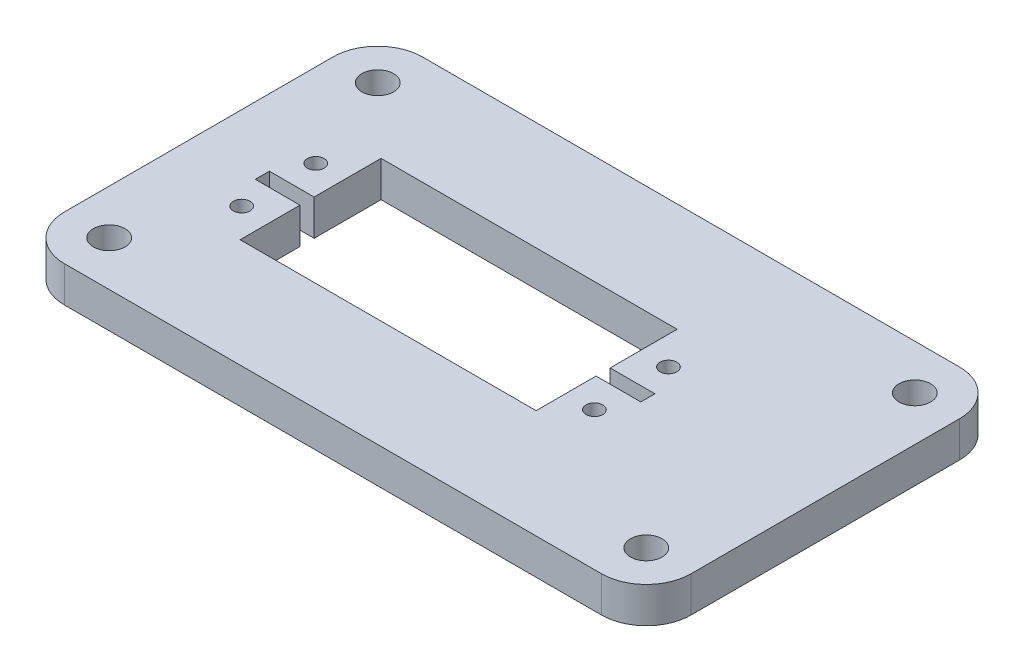
ISO-10303-21;
HEADER;
FILE_DESCRIPTION(('STEP AP214'),'2;1');
FILE_NAME('part.step','',(''),(''),'','','');
FILE_SCHEMA(('AUTOMOTIVE_DESIGN { 1 0 10303 214 1 1 1 1 }'));
ENDSEC;
DATA;
#1=APPLICATION_CONTEXT('core data for automotive mechanical design processes');
#2=APPLICATION_PROTOCOL_DEFINITION('international standard','automotive_design',2000,#1);
#3=PRODUCT_CONTEXT('',#1,'mechanical');
#4=PRODUCT('Part','Part','',(#3));
#5=PRODUCT_RELATED_PRODUCT_CATEGORY('part','',(#4));
#6=PRODUCT_DEFINITION_FORMATION('','',#4);
#7=PRODUCT_DEFINITION_CONTEXT('part definition',#1,'design');
#8=PRODUCT_DEFINITION('design','',#6,#7);
#9=PRODUCT_DEFINITION_SHAPE('','',#8);
#10=(LENGTH_UNIT() NAMED_UNIT(*) SI_UNIT(.MILLI.,.METRE.));
#11=(NAMED_UNIT(*) PLANE_ANGLE_UNIT() SI_UNIT($,.RADIAN.));
#12=(NAMED_UNIT(*) SI_UNIT($,.STERADIAN.) SOLID_ANGLE_UNIT());
#13=UNCERTAINTY_MEASURE_WITH_UNIT(LENGTH_MEASURE(1.E-05),#10,'distance_accuracy_value','');
#14=(GEOMETRIC_REPRESENTATION_CONTEXT(3) GLOBAL_UNCERTAINTY_ASSIGNED_CONTEXT((#13)) GLOBAL_UNIT_ASSIGNED_CONTEXT((#10,
#11,#12)) REPRESENTATION_CONTEXT('',''));
#15=CARTESIAN_POINT('',(0.,0.,0.));
#16=DIRECTION('',(0.,0.,1.));
#17=DIRECTION('',(1.,0.,0.));
#18=AXIS2_PLACEMENT_3D('',#15,#16,#17);
#19=CARTESIAN_POINT('',(0.,0.,0.));
#20=DIRECTION('',(0.,-1.,0.));
#21=DIRECTION('',(0.,0.,-1.));
#22=AXIS2_PLACEMENT_3D('',#19,#20,#21);
#23=PLANE('',#22);
#24=CARTESIAN_POINT('',(-82.55,0.,44.45));
#25=DIRECTION('',(0.,1.,0.));
#26=DIRECTION('',(0.,0.,1.));
#27=AXIS2_PLACEMENT_3D('',#24,#25,#26);
#28=CIRCLE('',#27,2.2479);
#29=CARTESIAN_POINT('',(-82.55,0.,46.6979));
#30=VERTEX_POINT('',#29);
#31=EDGE_CURVE('E711',#30,#30,#28,.T.);
#32=ORIENTED_EDGE('',*,*,#31,.T.);
#33=EDGE_LOOP('',(#32));
#34=FACE_BOUND('',#33,.T.);
#35=CARTESIAN_POINT('',(-6.34999999999999,0.,6.35));
#36=DIRECTION('',(0.,1.,0.));
#37=DIRECTION('',(0.,0.,1.));
#38=AXIS2_PLACEMENT_3D('',#35,#36,#37);
#39=CIRCLE('',#38,2.2479);
#40=CARTESIAN_POINT('',(-6.34999999999999,0.,8.5979));
#41=VERTEX_POINT('',#40);
#42=EDGE_CURVE('E716',#41,#41,#39,.T.);
#43=ORIENTED_EDGE('',*,*,#42,.T.);
#44=EDGE_LOOP('',(#43));
#45=FACE_BOUND('',#44,.T.);
#46=CARTESIAN_POINT('',(-6.35,0.,44.45));
#47=DIRECTION('',(0.,1.,0.));
#48=DIRECTION('',(0.,0.,1.));
#49=AXIS2_PLACEMENT_3D('',#46,#47,#48);
#50=CIRCLE('',#49,2.2479);
#51=CARTESIAN_POINT('',(-6.35,0.,46.6979));
#52=VERTEX_POINT('',#51);
#53=EDGE_CURVE('E202',#52,#52,#50,.T.);
#54=ORIENTED_EDGE('',*,*,#53,.T.);
#55=EDGE_LOOP('',(#54));
#56=FACE_BOUND('',#55,.T.);
#57=DIRECTION('',(1.,0.,0.));
#58=VECTOR('',#57,1.);
#59=CARTESIAN_POINT('',(-73.025,0.,26.9));
#60=LINE('',#59,#58);
#61=CARTESIAN_POINT('',(-79.375,0.,26.9));
#62=VERTEX_POINT('',#61);
#63=CARTESIAN_POINT('',(-73.025,0.,26.9));
#64=VERTEX_POINT('',#63);
#65=EDGE_CURVE('E190',#62,#64,#60,.T.);
#66=ORIENTED_EDGE('',*,*,#65,.T.);
#67=DIRECTION('',(0.,0.,1.));
#68=VECTOR('',#67,1.);
#69=CARTESIAN_POINT('',(-73.025,0.,15.4));
#70=LINE('',#69,#68);
#71=CARTESIAN_POINT('',(-73.025,0.,35.4));
#72=VERTEX_POINT('',#71);
#73=EDGE_CURVE('E282',#64,#72,#70,.T.);
#74=ORIENTED_EDGE('',*,*,#73,.T.);
#75=DIRECTION('',(1.,0.,0.));
#76=VECTOR('',#75,1.);
#77=CARTESIAN_POINT('',(-73.025,0.,35.4));
#78=LINE('',#77,#76);
#79=CARTESIAN_POINT('',(-31.0249824,0.,35.4));
#80=VERTEX_POINT('',#79);
#81=EDGE_CURVE('E284',#72,#80,#78,.T.);
#82=ORIENTED_EDGE('',*,*,#81,.T.);
#83=DIRECTION('',(0.,0.,-1.));
#84=VECTOR('',#83,1.);
#85=CARTESIAN_POINT('',(-31.0249824,0.,15.4));
#86=LINE('',#85,#84);
#87=CARTESIAN_POINT('',(-31.0249824,0.,26.9));
#88=VERTEX_POINT('',#87);
#89=EDGE_CURVE('E277',#80,#88,#86,.T.);
#90=ORIENTED_EDGE('',*,*,#89,.T.);
#91=DIRECTION('',(1.,0.,0.));
#92=VECTOR('',#91,1.);
#93=CARTESIAN_POINT('',(-31.0249824,0.,26.9));
#94=LINE('',#93,#92);
#95=CARTESIAN_POINT('',(-24.6749824,0.,26.9));
#96=VERTEX_POINT('',#95);
#97=EDGE_CURVE('E215',#88,#96,#94,.T.);
#98=ORIENTED_EDGE('',*,*,#97,.T.);
#99=DIRECTION('',(0.,0.,-1.));
#100=VECTOR('',#99,1.);
#101=CARTESIAN_POINT('',(-24.6749824,0.,24.9));
#102=LINE('',#101,#100);
#103=CARTESIAN_POINT('',(-24.6749824,0.,24.9));
#104=VERTEX_POINT('',#103);
#105=EDGE_CURVE('E218',#96,#104,#102,.T.);
#106=ORIENTED_EDGE('',*,*,#105,.T.);
#107=DIRECTION('',(-1.,0.,0.));
#108=VECTOR('',#107,1.);
#109=CARTESIAN_POINT('',(-31.0249824,0.,24.9));
#110=LINE('',#109,#108);
#111=CARTESIAN_POINT('',(-31.0249824,0.,24.9));
#112=VERTEX_POINT('',#111);
#113=EDGE_CURVE('E222',#104,#112,#110,.T.);
#114=ORIENTED_EDGE('',*,*,#113,.T.);
#115=CARTESIAN_POINT('',(-31.0249824,0.,15.4));
#116=VERTEX_POINT('',#115);
#117=EDGE_CURVE('E263',#112,#116,#86,.T.);
#118=ORIENTED_EDGE('',*,*,#117,.T.);
#119=DIRECTION('',(-1.,0.,0.));
#120=VECTOR('',#119,1.);
#121=CARTESIAN_POINT('',(-31.0249824,0.,15.4));
#122=LINE('',#121,#120);
#123=CARTESIAN_POINT('',(-73.025,0.,15.4));
#124=VERTEX_POINT('',#123);
#125=EDGE_CURVE('E280',#116,#124,#122,.T.);
#126=ORIENTED_EDGE('',*,*,#125,.T.);
#127=CARTESIAN_POINT('',(-73.025,0.,24.9));
#128=VERTEX_POINT('',#127);
#129=EDGE_CURVE('E196',#124,#128,#70,.T.);
#130=ORIENTED_EDGE('',*,*,#129,.T.);
#131=DIRECTION('',(-1.,0.,0.));
#132=VECTOR('',#131,1.);
#133=CARTESIAN_POINT('',(-73.025,0.,24.9));
#134=LINE('',#133,#132);
#135=CARTESIAN_POINT('',(-79.375,0.,24.9));
#136=VERTEX_POINT('',#135);
#137=EDGE_CURVE('E174',#128,#136,#134,.T.);
#138=ORIENTED_EDGE('',*,*,#137,.T.);
#139=DIRECTION('',(0.,0.,1.));
#140=VECTOR('',#139,1.);
#141=CARTESIAN_POINT('',(-79.375,0.,24.9));
#142=LINE('',#141,#140);
#143=EDGE_CURVE('E185',#136,#62,#142,.T.);
#144=ORIENTED_EDGE('',*,*,#143,.T.);
#145=EDGE_LOOP('',(#66,#74,#82,#90,#98,#106,#114,#118,#126,#130,#138,#144));
#146=FACE_BOUND('',#145,.T.);
#147=CARTESIAN_POINT('',(-77.0439912,0.,31.15));
#148=DIRECTION('',(0.,1.,0.));
#149=DIRECTION('',(0.,0.,1.));
#150=AXIS2_PLACEMENT_3D('',#147,#148,#149);
#151=CIRCLE('',#150,1.190625);
#152=CARTESIAN_POINT('',(-77.0439912,0.,32.340625));
#153=VERTEX_POINT('',#152);
#154=EDGE_CURVE('E242',#153,#153,#151,.T.);
#155=ORIENTED_EDGE('',*,*,#154,.T.);
#156=EDGE_LOOP('',(#155));
#157=FACE_BOUND('',#156,.T.);
#158=CARTESIAN_POINT('',(-77.0439912,0.,20.65));
#159=DIRECTION('',(0.,1.,0.));
#160=DIRECTION('',(0.,0.,1.));
#161=AXIS2_PLACEMENT_3D('',#158,#159,#160);
#162=CIRCLE('',#161,1.190625);
#163=CARTESIAN_POINT('',(-77.0439912,0.,21.840625));
#164=VERTEX_POINT('',#163);
#165=EDGE_CURVE('E248',#164,#164,#162,.T.);
#166=ORIENTED_EDGE('',*,*,#165,.T.);
#167=EDGE_LOOP('',(#166));
#168=FACE_BOUND('',#167,.T.);
#169=CARTESIAN_POINT('',(-27.0059912,0.,31.15));
#170=DIRECTION('',(0.,1.,0.));
#171=DIRECTION('',(0.,0.,1.));
#172=AXIS2_PLACEMENT_3D('',#169,#170,#171);
#173=CIRCLE('',#172,1.190625);
#174=CARTESIAN_POINT('',(-27.0059912,0.,32.340625));
#175=VERTEX_POINT('',#174);
#176=EDGE_CURVE('E254',#175,#175,#173,.T.);
#177=ORIENTED_EDGE('',*,*,#176,.T.);
#178=EDGE_LOOP('',(#177));
#179=FACE_BOUND('',#178,.T.);
#180=CARTESIAN_POINT('',(-27.0059912,0.,20.65));
#181=DIRECTION('',(0.,1.,0.));
#182=DIRECTION('',(0.,0.,1.));
#183=AXIS2_PLACEMENT_3D('',#180,#181,#182);
#184=CIRCLE('',#183,1.190625);
#185=CARTESIAN_POINT('',(-27.0059912,0.,21.840625));
#186=VERTEX_POINT('',#185);
#187=EDGE_CURVE('E260',#186,#186,#184,.T.);
#188=ORIENTED_EDGE('',*,*,#187,.T.);
#189=EDGE_LOOP('',(#188));
#190=FACE_BOUND('',#189,.T.);
#191=DIRECTION('',(0.,0.,-1.));
#192=VECTOR('',#191,1.);
#193=CARTESIAN_POINT('',(0.,0.,0.));
#194=LINE('',#193,#192);
#195=CARTESIAN_POINT('',(0.,0.,44.45));
#196=VERTEX_POINT('',#195);
#197=CARTESIAN_POINT('',(0.,0.,6.35));
#198=VERTEX_POINT('',#197);
#199=EDGE_CURVE('E315',#196,#198,#194,.T.);
#200=ORIENTED_EDGE('',*,*,#199,.F.);
#201=CARTESIAN_POINT('',(-6.35,0.,44.45));
#202=DIRECTION('',(0.,-1.,0.));
#203=DIRECTION('',(0.,0.,-1.));
#204=AXIS2_PLACEMENT_3D('',#201,#202,#203);
#205=CIRCLE('',#204,6.35);
#206=CARTESIAN_POINT('',(-6.35,0.,50.8));
#207=VERTEX_POINT('',#206);
#208=EDGE_CURVE('E329',#196,#207,#205,.T.);
#209=ORIENTED_EDGE('',*,*,#208,.T.);
#210=DIRECTION('',(1.,0.,0.));
#211=VECTOR('',#210,1.);
#212=CARTESIAN_POINT('',(0.,0.,50.8));
#213=LINE('',#212,#211);
#214=CARTESIAN_POINT('',(-82.55,0.,50.8));
#215=VERTEX_POINT('',#214);
#216=EDGE_CURVE('E312',#215,#207,#213,.T.);
#217=ORIENTED_EDGE('',*,*,#216,.F.);
#218=CARTESIAN_POINT('',(-82.55,0.,44.45));
#219=DIRECTION('',(0.,-1.,0.));
#220=DIRECTION('',(0.,0.,-1.));
#221=AXIS2_PLACEMENT_3D('',#218,#219,#220);
#222=CIRCLE('',#221,6.35);
#223=CARTESIAN_POINT('',(-88.9,0.,44.45));
#224=VERTEX_POINT('',#223);
#225=EDGE_CURVE('E325',#215,#224,#222,.T.);
#226=ORIENTED_EDGE('',*,*,#225,.T.);
#227=DIRECTION('',(0.,0.,1.));
#228=VECTOR('',#227,1.);
#229=CARTESIAN_POINT('',(-88.9,0.,50.8));
#230=LINE('',#229,#228);
#231=CARTESIAN_POINT('',(-88.9,0.,6.35));
#232=VERTEX_POINT('',#231);
#233=EDGE_CURVE('E297',#232,#224,#230,.T.);
#234=ORIENTED_EDGE('',*,*,#233,.F.);
#235=CARTESIAN_POINT('',(-82.55,0.,6.35));
#236=DIRECTION('',(0.,-1.,0.));
#237=DIRECTION('',(0.,0.,-1.));
#238=AXIS2_PLACEMENT_3D('',#235,#236,#237);
#239=CIRCLE('',#238,6.35);
#240=CARTESIAN_POINT('',(-82.55,0.,0.));
#241=VERTEX_POINT('',#240);
#242=EDGE_CURVE('E323',#232,#241,#239,.T.);
#243=ORIENTED_EDGE('',*,*,#242,.T.);
#244=DIRECTION('',(-1.,0.,0.));
#245=VECTOR('',#244,1.);
#246=CARTESIAN_POINT('',(-88.9,0.,0.));
#247=LINE('',#246,#245);
#248=CARTESIAN_POINT('',(-6.34999999999999,0.,0.));
#249=VERTEX_POINT('',#248);
#250=EDGE_CURVE('E302',#249,#241,#247,.T.);
#251=ORIENTED_EDGE('',*,*,#250,.F.);
#252=CARTESIAN_POINT('',(-6.34999999999999,0.,6.35));
#253=DIRECTION('',(0.,-1.,0.));
#254=DIRECTION('',(0.,0.,-1.));
#255=AXIS2_PLACEMENT_3D('',#252,#253,#254);
#256=CIRCLE('',#255,6.35);
#257=EDGE_CURVE('E327',#249,#198,#256,.T.);
#258=ORIENTED_EDGE('',*,*,#257,.T.);
#259=EDGE_LOOP('',(#200,#209,#217,#226,#234,#243,#251,#258));
#260=FACE_BOUND('',#259,.T.);
#261=CARTESIAN_POINT('',(-82.55,0.,6.35));
#262=DIRECTION('',(0.,1.,0.));
#263=DIRECTION('',(0.,0.,1.));
#264=AXIS2_PLACEMENT_3D('',#261,#262,#263);
#265=CIRCLE('',#264,2.2479);
#266=CARTESIAN_POINT('',(-82.55,0.,8.5979));
#267=VERTEX_POINT('',#266);
#268=EDGE_CURVE('E701',#267,#267,#265,.T.);
#269=ORIENTED_EDGE('',*,*,#268,.T.);
#270=EDGE_LOOP('',(#269));
#271=FACE_BOUND('',#270,.T.);
#272=ADVANCED_FACE('F33',(#34,#45,#56,#146,#157,#168,#179,#190,#260,#271),#23,.T.);
#273=CARTESIAN_POINT('',(-31.0249824,5.08,15.4));
#274=DIRECTION('',(-1.,0.,0.));
#275=DIRECTION('',(0.,0.,1.));
#276=AXIS2_PLACEMENT_3D('',#273,#274,#275);
#277=PLANE('',#276);
#278=DIRECTION('',(0.,1.,0.));
#279=VECTOR('',#278,1.);
#280=CARTESIAN_POINT('',(-31.0249824,0.,24.9));
#281=LINE('',#280,#279);
#282=CARTESIAN_POINT('',(-31.0249824,5.08,24.9));
#283=VERTEX_POINT('',#282);
#284=EDGE_CURVE('E207',#112,#283,#281,.T.);
#285=ORIENTED_EDGE('',*,*,#284,.T.);
#286=DIRECTION('',(0.,0.,-1.));
#287=VECTOR('',#286,1.);
#288=CARTESIAN_POINT('',(-31.0249824,5.08,15.4));
#289=LINE('',#288,#287);
#290=CARTESIAN_POINT('',(-31.0249824,5.08,15.4));
#291=VERTEX_POINT('',#290);
#292=EDGE_CURVE('E268',#283,#291,#289,.T.);
#293=ORIENTED_EDGE('',*,*,#292,.T.);
#294=DIRECTION('',(0.,-1.,0.));
#295=VECTOR('',#294,1.);
#296=CARTESIAN_POINT('',(-31.0249824,5.08,15.4));
#297=LINE('',#296,#295);
#298=EDGE_CURVE('E294',#291,#116,#297,.T.);
#299=ORIENTED_EDGE('',*,*,#298,.T.);
#300=ORIENTED_EDGE('',*,*,#117,.F.);
#301=EDGE_LOOP('',(#285,#293,#299,#300));
#302=FACE_BOUND('',#301,.T.);
#303=ADVANCED_FACE('F392',(#302),#277,.T.);
#304=CARTESIAN_POINT('',(-73.025,5.08,15.4));
#305=DIRECTION('',(1.,0.,0.));
#306=DIRECTION('',(0.,0.,-1.));
#307=AXIS2_PLACEMENT_3D('',#304,#305,#306);
#308=PLANE('',#307);
#309=DIRECTION('',(0.,1.,0.));
#310=VECTOR('',#309,1.);
#311=CARTESIAN_POINT('',(-73.025,0.,26.9));
#312=LINE('',#311,#310);
#313=CARTESIAN_POINT('',(-73.025,5.08,26.9));
#314=VERTEX_POINT('',#313);
#315=EDGE_CURVE('E209',#64,#314,#312,.T.);
#316=ORIENTED_EDGE('',*,*,#315,.T.);
#317=DIRECTION('',(0.,0.,1.));
#318=VECTOR('',#317,1.);
#319=CARTESIAN_POINT('',(-73.025,5.08,15.4));
#320=LINE('',#319,#318);
#321=CARTESIAN_POINT('',(-73.025,5.08,35.4));
#322=VERTEX_POINT('',#321);
#323=EDGE_CURVE('E270',#314,#322,#320,.T.);
#324=ORIENTED_EDGE('',*,*,#323,.T.);
#325=DIRECTION('',(0.,-1.,0.));
#326=VECTOR('',#325,1.);
#327=CARTESIAN_POINT('',(-73.025,5.08,35.4));
#328=LINE('',#327,#326);
#329=EDGE_CURVE('E289',#322,#72,#328,.T.);
#330=ORIENTED_EDGE('',*,*,#329,.T.);
#331=ORIENTED_EDGE('',*,*,#73,.F.);
#332=EDGE_LOOP('',(#316,#324,#330,#331));
#333=FACE_BOUND('',#332,.T.);
#334=ADVANCED_FACE('F398',(#333),#308,.T.);
#335=CARTESIAN_POINT('',(0.,5.08,0.));
#336=DIRECTION('',(0.,-1.,0.));
#337=DIRECTION('',(0.,0.,-1.));
#338=AXIS2_PLACEMENT_3D('',#335,#336,#337);
#339=PLANE('',#338);
#340=CARTESIAN_POINT('',(-82.55,5.08,6.35));
#341=DIRECTION('',(0.,1.,0.));
#342=DIRECTION('',(0.,0.,1.));
#343=AXIS2_PLACEMENT_3D('',#340,#341,#342);
#344=CIRCLE('',#343,2.2479);
#345=CARTESIAN_POINT('',(-82.55,5.08,8.5979));
#346=VERTEX_POINT('',#345);
#347=EDGE_CURVE('E704',#346,#346,#344,.T.);
#348=ORIENTED_EDGE('',*,*,#347,.F.);
#349=EDGE_LOOP('',(#348));
#350=FACE_BOUND('',#349,.T.);
#351=CARTESIAN_POINT('',(-82.55,5.08,44.45));
#352=DIRECTION('',(0.,1.,0.));
#353=DIRECTION('',(0.,0.,1.));
#354=AXIS2_PLACEMENT_3D('',#351,#352,#353);
#355=CIRCLE('',#354,2.2479);
#356=CARTESIAN_POINT('',(-82.55,5.08,46.6979));
#357=VERTEX_POINT('',#356);
#358=EDGE_CURVE('E706',#357,#357,#355,.T.);
#359=ORIENTED_EDGE('',*,*,#358,.F.);
#360=EDGE_LOOP('',(#359));
#361=FACE_BOUND('',#360,.T.);
#362=CARTESIAN_POINT('',(-6.34999999999999,5.08,6.35));
#363=DIRECTION('',(0.,1.,0.));
#364=DIRECTION('',(0.,0.,1.));
#365=AXIS2_PLACEMENT_3D('',#362,#363,#364);
#366=CIRCLE('',#365,2.2479);
#367=CARTESIAN_POINT('',(-6.34999999999999,5.08,8.5979));
#368=VERTEX_POINT('',#367);
#369=EDGE_CURVE('E713',#368,#368,#366,.T.);
#370=ORIENTED_EDGE('',*,*,#369,.F.);
#371=EDGE_LOOP('',(#370));
#372=FACE_BOUND('',#371,.T.);
#373=CARTESIAN_POINT('',(-6.35,5.08,44.45));
#374=DIRECTION('',(0.,1.,0.));
#375=DIRECTION('',(0.,0.,1.));
#376=AXIS2_PLACEMENT_3D('',#373,#374,#375);
#377=CIRCLE('',#376,2.2479);
#378=CARTESIAN_POINT('',(-6.35,5.08,46.6979));
#379=VERTEX_POINT('',#378);
#380=EDGE_CURVE('E718',#379,#379,#377,.T.);
#381=ORIENTED_EDGE('',*,*,#380,.F.);
#382=EDGE_LOOP('',(#381));
#383=FACE_BOUND('',#382,.T.);
#384=CARTESIAN_POINT('',(-77.0439912,5.08,31.15));
#385=DIRECTION('',(0.,1.,0.));
#386=DIRECTION('',(0.,0.,1.));
#387=AXIS2_PLACEMENT_3D('',#384,#385,#386);
#388=CIRCLE('',#387,1.190625);
#389=CARTESIAN_POINT('',(-77.0439912,5.08,32.340625));
#390=VERTEX_POINT('',#389);
#391=EDGE_CURVE('E212',#390,#390,#388,.T.);
#392=ORIENTED_EDGE('',*,*,#391,.F.);
#393=EDGE_LOOP('',(#392));
#394=FACE_BOUND('',#393,.T.);
#395=CARTESIAN_POINT('',(-77.0439912,5.08,20.65));
#396=DIRECTION('',(0.,1.,0.));
#397=DIRECTION('',(0.,0.,1.));
#398=AXIS2_PLACEMENT_3D('',#395,#396,#397);
#399=CIRCLE('',#398,1.190625);
#400=CARTESIAN_POINT('',(-77.0439912,5.08,21.840625));
#401=VERTEX_POINT('',#400);
#402=EDGE_CURVE('E245',#401,#401,#399,.T.);
#403=ORIENTED_EDGE('',*,*,#402,.F.);
#404=EDGE_LOOP('',(#403));
#405=FACE_BOUND('',#404,.T.);
#406=CARTESIAN_POINT('',(-27.0059912,5.08,31.15));
#407=DIRECTION('',(0.,1.,0.));
#408=DIRECTION('',(0.,0.,1.));
#409=AXIS2_PLACEMENT_3D('',#406,#407,#408);
#410=CIRCLE('',#409,1.190625);
#411=CARTESIAN_POINT('',(-27.0059912,5.08,32.340625));
#412=VERTEX_POINT('',#411);
#413=EDGE_CURVE('E251',#412,#412,#410,.T.);
#414=ORIENTED_EDGE('',*,*,#413,.F.);
#415=EDGE_LOOP('',(#414));
#416=FACE_BOUND('',#415,.T.);
#417=CARTESIAN_POINT('',(-27.0059912,5.08,20.65));
#418=DIRECTION('',(0.,1.,0.));
#419=DIRECTION('',(0.,0.,1.));
#420=AXIS2_PLACEMENT_3D('',#417,#418,#419);
#421=CIRCLE('',#420,1.190625);
#422=CARTESIAN_POINT('',(-27.0059912,5.08,21.840625));
#423=VERTEX_POINT('',#422);
#424=EDGE_CURVE('E257',#423,#423,#421,.T.);
#425=ORIENTED_EDGE('',*,*,#424,.F.);
#426=EDGE_LOOP('',(#425));
#427=FACE_BOUND('',#426,.T.);
#428=DIRECTION('',(1.,0.,0.));
#429=VECTOR('',#428,1.);
#430=CARTESIAN_POINT('',(0.,5.08,50.8));
#431=LINE('',#430,#429);
#432=CARTESIAN_POINT('',(-82.55,5.08,50.8));
#433=VERTEX_POINT('',#432);
#434=CARTESIAN_POINT('',(-6.35,5.08,50.8));
#435=VERTEX_POINT('',#434);
#436=EDGE_CURVE('E301',#433,#435,#431,.T.);
#437=ORIENTED_EDGE('',*,*,#436,.T.);
#438=CARTESIAN_POINT('',(-6.35,5.08,44.45));
#439=DIRECTION('',(0.,-1.,0.));
#440=DIRECTION('',(0.,0.,-1.));
#441=AXIS2_PLACEMENT_3D('',#438,#439,#440);
#442=CIRCLE('',#441,6.35);
#443=CARTESIAN_POINT('',(0.,5.08,44.45));
#444=VERTEX_POINT('',#443);
#445=EDGE_CURVE('E341',#435,#444,#442,.F.);
#446=ORIENTED_EDGE('',*,*,#445,.T.);
#447=DIRECTION('',(0.,0.,-1.));
#448=VECTOR('',#447,1.);
#449=CARTESIAN_POINT('',(0.,5.08,0.));
#450=LINE('',#449,#448);
#451=CARTESIAN_POINT('',(0.,5.08,6.35));
#452=VERTEX_POINT('',#451);
#453=EDGE_CURVE('E305',#444,#452,#450,.T.);
#454=ORIENTED_EDGE('',*,*,#453,.T.);
#455=CARTESIAN_POINT('',(-6.34999999999999,5.08,6.35));
#456=DIRECTION('',(0.,-1.,0.));
#457=DIRECTION('',(0.,0.,-1.));
#458=AXIS2_PLACEMENT_3D('',#455,#456,#457);
#459=CIRCLE('',#458,6.35);
#460=CARTESIAN_POINT('',(-6.34999999999999,5.08,0.));
#461=VERTEX_POINT('',#460);
#462=EDGE_CURVE('E55',#452,#461,#459,.F.);
#463=ORIENTED_EDGE('',*,*,#462,.T.);
#464=DIRECTION('',(-1.,0.,0.));
#465=VECTOR('',#464,1.);
#466=CARTESIAN_POINT('',(-88.9,5.08,0.));
#467=LINE('',#466,#465);
#468=CARTESIAN_POINT('',(-82.55,5.08,0.));
#469=VERTEX_POINT('',#468);
#470=EDGE_CURVE('E307',#461,#469,#467,.T.);
#471=ORIENTED_EDGE('',*,*,#470,.T.);
#472=CARTESIAN_POINT('',(-82.55,5.08,6.35));
#473=DIRECTION('',(0.,-1.,0.));
#474=DIRECTION('',(0.,0.,-1.));
#475=AXIS2_PLACEMENT_3D('',#472,#473,#474);
#476=CIRCLE('',#475,6.35);
#477=CARTESIAN_POINT('',(-88.9,5.08,6.35));
#478=VERTEX_POINT('',#477);
#479=EDGE_CURVE('E336',#469,#478,#476,.F.);
#480=ORIENTED_EDGE('',*,*,#479,.T.);
#481=DIRECTION('',(0.,0.,1.));
#482=VECTOR('',#481,1.);
#483=CARTESIAN_POINT('',(-88.9,5.08,50.8));
#484=LINE('',#483,#482);
#485=CARTESIAN_POINT('',(-88.9,5.08,44.45));
#486=VERTEX_POINT('',#485);
#487=EDGE_CURVE('E298',#478,#486,#484,.T.);
#488=ORIENTED_EDGE('',*,*,#487,.T.);
#489=CARTESIAN_POINT('',(-82.55,5.08,44.45));
#490=DIRECTION('',(0.,-1.,0.));
#491=DIRECTION('',(0.,0.,-1.));
#492=AXIS2_PLACEMENT_3D('',#489,#490,#491);
#493=CIRCLE('',#492,6.35);
#494=EDGE_CURVE('E338',#486,#433,#493,.F.);
#495=ORIENTED_EDGE('',*,*,#494,.T.);
#496=EDGE_LOOP('',(#437,#446,#454,#463,#471,#480,#488,#495));
#497=FACE_BOUND('',#496,.T.);
#498=ORIENTED_EDGE('',*,*,#323,.F.);
#499=DIRECTION('',(1.,0.,0.));
#500=VECTOR('',#499,1.);
#501=CARTESIAN_POINT('',(-73.025,5.08,26.9));
#502=LINE('',#501,#500);
#503=CARTESIAN_POINT('',(-79.375,5.08,26.9));
#504=VERTEX_POINT('',#503);
#505=EDGE_CURVE('E197',#504,#314,#502,.T.);
#506=ORIENTED_EDGE('',*,*,#505,.F.);
#507=DIRECTION('',(0.,0.,1.));
#508=VECTOR('',#507,1.);
#509=CARTESIAN_POINT('',(-79.375,5.08,24.9));
#510=LINE('',#509,#508);
#511=CARTESIAN_POINT('',(-79.375,5.08,24.9));
#512=VERTEX_POINT('',#511);
#513=EDGE_CURVE('E199',#512,#504,#510,.T.);
#514=ORIENTED_EDGE('',*,*,#513,.F.);
#515=DIRECTION('',(-1.,0.,0.));
#516=VECTOR('',#515,1.);
#517=CARTESIAN_POINT('',(-73.025,5.08,24.9));
#518=LINE('',#517,#516);
#519=CARTESIAN_POINT('',(-73.025,5.08,24.9));
#520=VERTEX_POINT('',#519);
#521=EDGE_CURVE('E177',#520,#512,#518,.T.);
#522=ORIENTED_EDGE('',*,*,#521,.F.);
#523=CARTESIAN_POINT('',(-73.025,5.08,15.4));
#524=VERTEX_POINT('',#523);
#525=EDGE_CURVE('E271',#524,#520,#320,.T.);
#526=ORIENTED_EDGE('',*,*,#525,.F.);
#527=DIRECTION('',(-1.,0.,0.));
#528=VECTOR('',#527,1.);
#529=CARTESIAN_POINT('',(-31.0249824,5.08,15.4));
#530=LINE('',#529,#528);
#531=EDGE_CURVE('E267',#291,#524,#530,.T.);
#532=ORIENTED_EDGE('',*,*,#531,.F.);
#533=ORIENTED_EDGE('',*,*,#292,.F.);
#534=DIRECTION('',(-1.,0.,0.));
#535=VECTOR('',#534,1.);
#536=CARTESIAN_POINT('',(-31.0249824,5.08,24.9));
#537=LINE('',#536,#535);
#538=CARTESIAN_POINT('',(-24.6749824,5.08,24.9));
#539=VERTEX_POINT('',#538);
#540=EDGE_CURVE('E219',#539,#283,#537,.T.);
#541=ORIENTED_EDGE('',*,*,#540,.F.);
#542=DIRECTION('',(0.,0.,-1.));
#543=VECTOR('',#542,1.);
#544=CARTESIAN_POINT('',(-24.6749824,5.08,24.9));
#545=LINE('',#544,#543);
#546=CARTESIAN_POINT('',(-24.6749824,5.08,26.9));
#547=VERTEX_POINT('',#546);
#548=EDGE_CURVE('E229',#547,#539,#545,.T.);
#549=ORIENTED_EDGE('',*,*,#548,.F.);
#550=DIRECTION('',(1.,0.,0.));
#551=VECTOR('',#550,1.);
#552=CARTESIAN_POINT('',(-31.0249824,5.08,26.9));
#553=LINE('',#552,#551);
#554=CARTESIAN_POINT('',(-31.0249824,5.08,26.9));
#555=VERTEX_POINT('',#554);
#556=EDGE_CURVE('E226',#555,#547,#553,.T.);
#557=ORIENTED_EDGE('',*,*,#556,.F.);
#558=CARTESIAN_POINT('',(-31.0249824,5.08,35.4));
#559=VERTEX_POINT('',#558);
#560=EDGE_CURVE('E264',#559,#555,#289,.T.);
#561=ORIENTED_EDGE('',*,*,#560,.F.);
#562=DIRECTION('',(1.,0.,0.));
#563=VECTOR('',#562,1.);
#564=CARTESIAN_POINT('',(-73.025,5.08,35.4));
#565=LINE('',#564,#563);
#566=EDGE_CURVE('E274',#322,#559,#565,.T.);
#567=ORIENTED_EDGE('',*,*,#566,.F.);
#568=EDGE_LOOP('',(#498,#506,#514,#522,#526,#532,#533,#541,#549,#557,#561,#567));
#569=FACE_BOUND('',#568,.T.);
#570=ADVANCED_FACE('F369',(#350,#361,#372,#383,#394,#405,#416,#427,#497,#569),#339,.F.);
#571=CARTESIAN_POINT('',(-88.9,5.08,50.8));
#572=DIRECTION('',(1.,0.,0.));
#573=DIRECTION('',(0.,0.,-1.));
#574=AXIS2_PLACEMENT_3D('',#571,#572,#573);
#575=PLANE('',#574);
#576=ORIENTED_EDGE('',*,*,#233,.T.);
#577=DIRECTION('',(0.,-1.,0.));
#578=VECTOR('',#577,1.);
#579=CARTESIAN_POINT('',(-88.9,5.08,44.45));
#580=LINE('',#579,#578);
#581=EDGE_CURVE('E11',#224,#486,#580,.F.);
#582=ORIENTED_EDGE('',*,*,#581,.T.);
#583=ORIENTED_EDGE('',*,*,#487,.F.);
#584=DIRECTION('',(0.,-1.,0.));
#585=VECTOR('',#584,1.);
#586=CARTESIAN_POINT('',(-88.9,5.08,6.35));
#587=LINE('',#586,#585);
#588=EDGE_CURVE('E41',#478,#232,#587,.T.);
#589=ORIENTED_EDGE('',*,*,#588,.T.);
#590=EDGE_LOOP('',(#576,#582,#583,#589));
#591=FACE_BOUND('',#590,.T.);
#592=ADVANCED_FACE('F351',(#591),#575,.F.);
#593=CARTESIAN_POINT('',(0.,5.08,50.8));
#594=DIRECTION('',(0.,0.,-1.));
#595=DIRECTION('',(-1.,0.,0.));
#596=AXIS2_PLACEMENT_3D('',#593,#594,#595);
#597=PLANE('',#596);
#598=ORIENTED_EDGE('',*,*,#216,.T.);
#599=DIRECTION('',(0.,-1.,0.));
#600=VECTOR('',#599,1.);
#601=CARTESIAN_POINT('',(-6.35,5.08,50.8));
#602=LINE('',#601,#600);
#603=EDGE_CURVE('E334',#207,#435,#602,.F.);
#604=ORIENTED_EDGE('',*,*,#603,.T.);
#605=ORIENTED_EDGE('',*,*,#436,.F.);
#606=DIRECTION('',(0.,-1.,0.));
#607=VECTOR('',#606,1.);
#608=CARTESIAN_POINT('',(-82.55,5.08,50.8));
#609=LINE('',#608,#607);
#610=EDGE_CURVE('E331',#433,#215,#609,.T.);
#611=ORIENTED_EDGE('',*,*,#610,.T.);
#612=EDGE_LOOP('',(#598,#604,#605,#611));
#613=FACE_BOUND('',#612,.T.);
#614=ADVANCED_FACE('F366',(#613),#597,.F.);
#615=CARTESIAN_POINT('',(0.,5.08,0.));
#616=DIRECTION('',(-1.,0.,0.));
#617=DIRECTION('',(0.,0.,1.));
#618=AXIS2_PLACEMENT_3D('',#615,#616,#617);
#619=PLANE('',#618);
#620=ORIENTED_EDGE('',*,*,#453,.F.);
#621=DIRECTION('',(0.,-1.,0.));
#622=VECTOR('',#621,1.);
#623=CARTESIAN_POINT('',(0.,5.08,44.45));
#624=LINE('',#623,#622);
#625=EDGE_CURVE('E320',#444,#196,#624,.T.);
#626=ORIENTED_EDGE('',*,*,#625,.T.);
#627=ORIENTED_EDGE('',*,*,#199,.T.);
#628=DIRECTION('',(0.,-1.,0.));
#629=VECTOR('',#628,1.);
#630=CARTESIAN_POINT('',(0.,5.08,6.35));
#631=LINE('',#630,#629);
#632=EDGE_CURVE('E309',#198,#452,#631,.F.);
#633=ORIENTED_EDGE('',*,*,#632,.T.);
#634=EDGE_LOOP('',(#620,#626,#627,#633));
#635=FACE_BOUND('',#634,.T.);
#636=ADVANCED_FACE('F376',(#635),#619,.F.);
#637=CARTESIAN_POINT('',(-88.9,5.08,0.));
#638=DIRECTION('',(0.,0.,1.));
#639=DIRECTION('',(1.,0.,0.));
#640=AXIS2_PLACEMENT_3D('',#637,#638,#639);
#641=PLANE('',#640);
#642=ORIENTED_EDGE('',*,*,#470,.F.);
#643=DIRECTION('',(0.,-1.,0.));
#644=VECTOR('',#643,1.);
#645=CARTESIAN_POINT('',(-6.34999999999999,5.08,0.));
#646=LINE('',#645,#644);
#647=EDGE_CURVE('E344',#461,#249,#646,.T.);
#648=ORIENTED_EDGE('',*,*,#647,.T.);
#649=ORIENTED_EDGE('',*,*,#250,.T.);
#650=DIRECTION('',(0.,-1.,0.));
#651=VECTOR('',#650,1.);
#652=CARTESIAN_POINT('',(-82.55,5.08,0.));
#653=LINE('',#652,#651);
#654=EDGE_CURVE('E48',#241,#469,#653,.F.);
#655=ORIENTED_EDGE('',*,*,#654,.T.);
#656=EDGE_LOOP('',(#642,#648,#649,#655));
#657=FACE_BOUND('',#656,.T.);
#658=ADVANCED_FACE('F381',(#657),#641,.F.);
#659=DIRECTION('',(0.,1.,0.));
#660=VECTOR('',#659,1.);
#661=CARTESIAN_POINT('',(-31.0249824,0.,26.9));
#662=LINE('',#661,#660);
#663=EDGE_CURVE('E225',#88,#555,#662,.T.);
#664=ORIENTED_EDGE('',*,*,#663,.F.);
#665=ORIENTED_EDGE('',*,*,#89,.F.);
#666=DIRECTION('',(0.,-1.,0.));
#667=VECTOR('',#666,1.);
#668=CARTESIAN_POINT('',(-31.0249824,5.08,35.4));
#669=LINE('',#668,#667);
#670=EDGE_CURVE('E276',#559,#80,#669,.T.);
#671=ORIENTED_EDGE('',*,*,#670,.F.);
#672=ORIENTED_EDGE('',*,*,#560,.T.);
#673=EDGE_LOOP('',(#664,#665,#671,#672));
#674=FACE_BOUND('',#673,.T.);
#675=ADVANCED_FACE('F401',(#674),#277,.T.);
#676=CARTESIAN_POINT('',(-31.0249824,5.08,15.4));
#677=DIRECTION('',(0.,0.,1.));
#678=DIRECTION('',(1.,0.,0.));
#679=AXIS2_PLACEMENT_3D('',#676,#677,#678);
#680=PLANE('',#679);
#681=ORIENTED_EDGE('',*,*,#125,.F.);
#682=ORIENTED_EDGE('',*,*,#298,.F.);
#683=ORIENTED_EDGE('',*,*,#531,.T.);
#684=DIRECTION('',(0.,-1.,0.));
#685=VECTOR('',#684,1.);
#686=CARTESIAN_POINT('',(-73.025,5.08,15.4));
#687=LINE('',#686,#685);
#688=EDGE_CURVE('E292',#524,#124,#687,.T.);
#689=ORIENTED_EDGE('',*,*,#688,.T.);
#690=EDGE_LOOP('',(#681,#682,#683,#689));
#691=FACE_BOUND('',#690,.T.);
#692=ADVANCED_FACE('F528',(#691),#680,.T.);
#693=DIRECTION('',(0.,1.,0.));
#694=VECTOR('',#693,1.);
#695=CARTESIAN_POINT('',(-73.025,0.,24.9));
#696=LINE('',#695,#694);
#697=EDGE_CURVE('E182',#128,#520,#696,.T.);
#698=ORIENTED_EDGE('',*,*,#697,.F.);
#699=ORIENTED_EDGE('',*,*,#129,.F.);
#700=ORIENTED_EDGE('',*,*,#688,.F.);
#701=ORIENTED_EDGE('',*,*,#525,.T.);
#702=EDGE_LOOP('',(#698,#699,#700,#701));
#703=FACE_BOUND('',#702,.T.);
#704=ADVANCED_FACE('F524',(#703),#308,.T.);
#705=CARTESIAN_POINT('',(-73.025,5.08,35.4));
#706=DIRECTION('',(0.,0.,-1.));
#707=DIRECTION('',(-1.,0.,0.));
#708=AXIS2_PLACEMENT_3D('',#705,#706,#707);
#709=PLANE('',#708);
#710=ORIENTED_EDGE('',*,*,#81,.F.);
#711=ORIENTED_EDGE('',*,*,#329,.F.);
#712=ORIENTED_EDGE('',*,*,#566,.T.);
#713=ORIENTED_EDGE('',*,*,#670,.T.);
#714=EDGE_LOOP('',(#710,#711,#712,#713));
#715=FACE_BOUND('',#714,.T.);
#716=ADVANCED_FACE('F520',(#715),#709,.T.);
#717=CARTESIAN_POINT('',(-27.0059912,5.08,20.65));
#718=DIRECTION('',(0.,1.,0.));
#719=DIRECTION('',(0.,0.,1.));
#720=AXIS2_PLACEMENT_3D('',#717,#718,#719);
#721=CYLINDRICAL_SURFACE('',#720,1.190625);
#722=ORIENTED_EDGE('',*,*,#187,.F.);
#723=EDGE_LOOP('',(#722));
#724=FACE_BOUND('',#723,.T.);
#725=ORIENTED_EDGE('',*,*,#424,.T.);
#726=EDGE_LOOP('',(#725));
#727=FACE_BOUND('',#726,.T.);
#728=ADVANCED_FACE('F516',(#724,#727),#721,.F.);
#729=CARTESIAN_POINT('',(-27.0059912,5.08,31.15));
#730=DIRECTION('',(0.,1.,0.));
#731=DIRECTION('',(0.,0.,1.));
#732=AXIS2_PLACEMENT_3D('',#729,#730,#731);
#733=CYLINDRICAL_SURFACE('',#732,1.190625);
#734=ORIENTED_EDGE('',*,*,#176,.F.);
#735=EDGE_LOOP('',(#734));
#736=FACE_BOUND('',#735,.T.);
#737=ORIENTED_EDGE('',*,*,#413,.T.);
#738=EDGE_LOOP('',(#737));
#739=FACE_BOUND('',#738,.T.);
#740=ADVANCED_FACE('F512',(#736,#739),#733,.F.);
#741=CARTESIAN_POINT('',(-77.0439912,5.08,20.65));
#742=DIRECTION('',(0.,1.,0.));
#743=DIRECTION('',(0.,0.,1.));
#744=AXIS2_PLACEMENT_3D('',#741,#742,#743);
#745=CYLINDRICAL_SURFACE('',#744,1.190625);
#746=ORIENTED_EDGE('',*,*,#165,.F.);
#747=EDGE_LOOP('',(#746));
#748=FACE_BOUND('',#747,.T.);
#749=ORIENTED_EDGE('',*,*,#402,.T.);
#750=EDGE_LOOP('',(#749));
#751=FACE_BOUND('',#750,.T.);
#752=ADVANCED_FACE('F508',(#748,#751),#745,.F.);
#753=CARTESIAN_POINT('',(-77.0439912,5.08,31.15));
#754=DIRECTION('',(0.,1.,0.));
#755=DIRECTION('',(0.,0.,1.));
#756=AXIS2_PLACEMENT_3D('',#753,#754,#755);
#757=CYLINDRICAL_SURFACE('',#756,1.190625);
#758=ORIENTED_EDGE('',*,*,#154,.F.);
#759=EDGE_LOOP('',(#758));
#760=FACE_BOUND('',#759,.T.);
#761=ORIENTED_EDGE('',*,*,#391,.T.);
#762=EDGE_LOOP('',(#761));
#763=FACE_BOUND('',#762,.T.);
#764=ADVANCED_FACE('F490',(#760,#763),#757,.F.);
#765=CARTESIAN_POINT('',(-73.025,0.,26.9));
#766=DIRECTION('',(0.,0.,1.));
#767=DIRECTION('',(1.,0.,0.));
#768=AXIS2_PLACEMENT_3D('',#765,#766,#767);
#769=PLANE('',#768);
#770=ORIENTED_EDGE('',*,*,#505,.T.);
#771=ORIENTED_EDGE('',*,*,#315,.F.);
#772=ORIENTED_EDGE('',*,*,#65,.F.);
#773=DIRECTION('',(0.,1.,0.));
#774=VECTOR('',#773,1.);
#775=CARTESIAN_POINT('',(-79.375,0.,26.9));
#776=LINE('',#775,#774);
#777=EDGE_CURVE('E181',#62,#504,#776,.T.);
#778=ORIENTED_EDGE('',*,*,#777,.T.);
#779=EDGE_LOOP('',(#770,#771,#772,#778));
#780=FACE_BOUND('',#779,.T.);
#781=ADVANCED_FACE('F487',(#780),#769,.F.);
#782=CARTESIAN_POINT('',(-79.375,0.,24.9));
#783=DIRECTION('',(-1.,0.,0.));
#784=DIRECTION('',(0.,0.,1.));
#785=AXIS2_PLACEMENT_3D('',#782,#783,#784);
#786=PLANE('',#785);
#787=ORIENTED_EDGE('',*,*,#513,.T.);
#788=ORIENTED_EDGE('',*,*,#777,.F.);
#789=ORIENTED_EDGE('',*,*,#143,.F.);
#790=DIRECTION('',(0.,1.,0.));
#791=VECTOR('',#790,1.);
#792=CARTESIAN_POINT('',(-79.375,0.,24.9));
#793=LINE('',#792,#791);
#794=EDGE_CURVE('E170',#136,#512,#793,.T.);
#795=ORIENTED_EDGE('',*,*,#794,.T.);
#796=EDGE_LOOP('',(#787,#788,#789,#795));
#797=FACE_BOUND('',#796,.T.);
#798=ADVANCED_FACE('F186',(#797),#786,.F.);
#799=CARTESIAN_POINT('',(-73.025,0.,24.9));
#800=DIRECTION('',(0.,0.,-1.));
#801=DIRECTION('',(-1.,0.,0.));
#802=AXIS2_PLACEMENT_3D('',#799,#800,#801);
#803=PLANE('',#802);
#804=ORIENTED_EDGE('',*,*,#521,.T.);
#805=ORIENTED_EDGE('',*,*,#794,.F.);
#806=ORIENTED_EDGE('',*,*,#137,.F.);
#807=ORIENTED_EDGE('',*,*,#697,.T.);
#808=EDGE_LOOP('',(#804,#805,#806,#807));
#809=FACE_BOUND('',#808,.T.);
#810=ADVANCED_FACE('F172',(#809),#803,.F.);
#811=CARTESIAN_POINT('',(-31.0249824,0.,24.9));
#812=DIRECTION('',(0.,0.,-1.));
#813=DIRECTION('',(-1.,0.,0.));
#814=AXIS2_PLACEMENT_3D('',#811,#812,#813);
#815=PLANE('',#814);
#816=ORIENTED_EDGE('',*,*,#540,.T.);
#817=ORIENTED_EDGE('',*,*,#284,.F.);
#818=ORIENTED_EDGE('',*,*,#113,.F.);
#819=DIRECTION('',(0.,1.,0.));
#820=VECTOR('',#819,1.);
#821=CARTESIAN_POINT('',(-24.6749824,0.,24.9));
#822=LINE('',#821,#820);
#823=EDGE_CURVE('E235',#104,#539,#822,.T.);
#824=ORIENTED_EDGE('',*,*,#823,.T.);
#825=EDGE_LOOP('',(#816,#817,#818,#824));
#826=FACE_BOUND('',#825,.T.);
#827=ADVANCED_FACE('F496',(#826),#815,.F.);
#828=CARTESIAN_POINT('',(-24.6749824,0.,24.9));
#829=DIRECTION('',(1.,0.,0.));
#830=DIRECTION('',(0.,0.,-1.));
#831=AXIS2_PLACEMENT_3D('',#828,#829,#830);
#832=PLANE('',#831);
#833=ORIENTED_EDGE('',*,*,#548,.T.);
#834=ORIENTED_EDGE('',*,*,#823,.F.);
#835=ORIENTED_EDGE('',*,*,#105,.F.);
#836=DIRECTION('',(0.,1.,0.));
#837=VECTOR('',#836,1.);
#838=CARTESIAN_POINT('',(-24.6749824,0.,26.9));
#839=LINE('',#838,#837);
#840=EDGE_CURVE('E237',#96,#547,#839,.T.);
#841=ORIENTED_EDGE('',*,*,#840,.T.);
#842=EDGE_LOOP('',(#833,#834,#835,#841));
#843=FACE_BOUND('',#842,.T.);
#844=ADVANCED_FACE('F499',(#843),#832,.F.);
#845=CARTESIAN_POINT('',(-31.0249824,0.,26.9));
#846=DIRECTION('',(0.,0.,1.));
#847=DIRECTION('',(1.,0.,0.));
#848=AXIS2_PLACEMENT_3D('',#845,#846,#847);
#849=PLANE('',#848);
#850=ORIENTED_EDGE('',*,*,#556,.T.);
#851=ORIENTED_EDGE('',*,*,#840,.F.);
#852=ORIENTED_EDGE('',*,*,#97,.F.);
#853=ORIENTED_EDGE('',*,*,#663,.T.);
#854=EDGE_LOOP('',(#850,#851,#852,#853));
#855=FACE_BOUND('',#854,.T.);
#856=ADVANCED_FACE('F416',(#855),#849,.F.);
#857=CARTESIAN_POINT('',(-6.35,5.08,44.45));
#858=DIRECTION('',(0.,-1.,0.));
#859=DIRECTION('',(0.,0.,-1.));
#860=AXIS2_PLACEMENT_3D('',#857,#858,#859);
#861=CYLINDRICAL_SURFACE('',#860,6.35);
#862=ORIENTED_EDGE('',*,*,#445,.F.);
#863=ORIENTED_EDGE('',*,*,#603,.F.);
#864=ORIENTED_EDGE('',*,*,#208,.F.);
#865=ORIENTED_EDGE('',*,*,#625,.F.);
#866=EDGE_LOOP('',(#862,#863,#864,#865));
#867=FACE_BOUND('',#866,.T.);
#868=ADVANCED_FACE('F374',(#867),#861,.T.);
#869=CARTESIAN_POINT('',(-6.34999999999999,5.08,6.35));
#870=DIRECTION('',(0.,-1.,0.));
#871=DIRECTION('',(0.,0.,-1.));
#872=AXIS2_PLACEMENT_3D('',#869,#870,#871);
#873=CYLINDRICAL_SURFACE('',#872,6.35);
#874=ORIENTED_EDGE('',*,*,#462,.F.);
#875=ORIENTED_EDGE('',*,*,#632,.F.);
#876=ORIENTED_EDGE('',*,*,#257,.F.);
#877=ORIENTED_EDGE('',*,*,#647,.F.);
#878=EDGE_LOOP('',(#874,#875,#876,#877));
#879=FACE_BOUND('',#878,.T.);
#880=ADVANCED_FACE('F380',(#879),#873,.T.);
#881=CARTESIAN_POINT('',(-82.55,5.08,44.45));
#882=DIRECTION('',(0.,-1.,0.));
#883=DIRECTION('',(0.,0.,-1.));
#884=AXIS2_PLACEMENT_3D('',#881,#882,#883);
#885=CYLINDRICAL_SURFACE('',#884,6.35);
#886=ORIENTED_EDGE('',*,*,#494,.F.);
#887=ORIENTED_EDGE('',*,*,#581,.F.);
#888=ORIENTED_EDGE('',*,*,#225,.F.);
#889=ORIENTED_EDGE('',*,*,#610,.F.);
#890=EDGE_LOOP('',(#886,#887,#888,#889));
#891=FACE_BOUND('',#890,.T.);
#892=ADVANCED_FACE('F363',(#891),#885,.T.);
#893=CARTESIAN_POINT('',(-82.55,5.08,6.35));
#894=DIRECTION('',(0.,-1.,0.));
#895=DIRECTION('',(0.,0.,-1.));
#896=AXIS2_PLACEMENT_3D('',#893,#894,#895);
#897=CYLINDRICAL_SURFACE('',#896,6.35);
#898=ORIENTED_EDGE('',*,*,#479,.F.);
#899=ORIENTED_EDGE('',*,*,#654,.F.);
#900=ORIENTED_EDGE('',*,*,#242,.F.);
#901=ORIENTED_EDGE('',*,*,#588,.F.);
#902=EDGE_LOOP('',(#898,#899,#900,#901));
#903=FACE_BOUND('',#902,.T.);
#904=ADVANCED_FACE('F35',(#903),#897,.T.);
#905=CARTESIAN_POINT('',(-6.35,5.08,44.45));
#906=DIRECTION('',(0.,1.,0.));
#907=DIRECTION('',(0.,0.,1.));
#908=AXIS2_PLACEMENT_3D('',#905,#906,#907);
#909=CYLINDRICAL_SURFACE('',#908,2.2479);
#910=ORIENTED_EDGE('',*,*,#53,.F.);
#911=EDGE_LOOP('',(#910));
#912=FACE_BOUND('',#911,.T.);
#913=ORIENTED_EDGE('',*,*,#380,.T.);
#914=EDGE_LOOP('',(#913));
#915=FACE_BOUND('',#914,.T.);
#916=ADVANCED_FACE('F383',(#912,#915),#909,.F.);
#917=CARTESIAN_POINT('',(-6.34999999999999,5.08,6.35));
#918=DIRECTION('',(0.,1.,0.));
#919=DIRECTION('',(0.,0.,1.));
#920=AXIS2_PLACEMENT_3D('',#917,#918,#919);
#921=CYLINDRICAL_SURFACE('',#920,2.2479);
#922=ORIENTED_EDGE('',*,*,#42,.F.);
#923=EDGE_LOOP('',(#922));
#924=FACE_BOUND('',#923,.T.);
#925=ORIENTED_EDGE('',*,*,#369,.T.);
#926=EDGE_LOOP('',(#925));
#927=FACE_BOUND('',#926,.T.);
#928=ADVANCED_FACE('F388',(#924,#927),#921,.F.);
#929=CARTESIAN_POINT('',(-82.55,5.08,44.45));
#930=DIRECTION('',(0.,1.,0.));
#931=DIRECTION('',(0.,0.,1.));
#932=AXIS2_PLACEMENT_3D('',#929,#930,#931);
#933=CYLINDRICAL_SURFACE('',#932,2.2479);
#934=ORIENTED_EDGE('',*,*,#31,.F.);
#935=EDGE_LOOP('',(#934));
#936=FACE_BOUND('',#935,.T.);
#937=ORIENTED_EDGE('',*,*,#358,.T.);
#938=EDGE_LOOP('',(#937));
#939=FACE_BOUND('',#938,.T.);
#940=ADVANCED_FACE('F460',(#936,#939),#933,.F.);
#941=CARTESIAN_POINT('',(-82.55,5.08,6.35));
#942=DIRECTION('',(0.,1.,0.));
#943=DIRECTION('',(0.,0.,1.));
#944=AXIS2_PLACEMENT_3D('',#941,#942,#943);
#945=CYLINDRICAL_SURFACE('',#944,2.2479);
#946=ORIENTED_EDGE('',*,*,#268,.F.);
#947=EDGE_LOOP('',(#946));
#948=FACE_BOUND('',#947,.T.);
#949=ORIENTED_EDGE('',*,*,#347,.T.);
#950=EDGE_LOOP('',(#949));
#951=FACE_BOUND('',#950,.T.);
#952=ADVANCED_FACE('F470',(#948,#951),#945,.F.);
#953=CLOSED_SHELL('',(#272,#303,#334,#570,#592,#614,#636,#658,#675,#692,#704,#716,#728,#740,
#752,#764,#781,#798,#810,#827,#844,#856,#868,#880,#892,#904,#916,#928,#940,#952));
#954=MANIFOLD_SOLID_BREP('B2',#953);
#955=ADVANCED_BREP_SHAPE_REPRESENTATION('',(#18,#954),#14);
#956=SHAPE_DEFINITION_REPRESENTATION(#9,#955);
ENDSEC;
END-ISO-10303-21;
